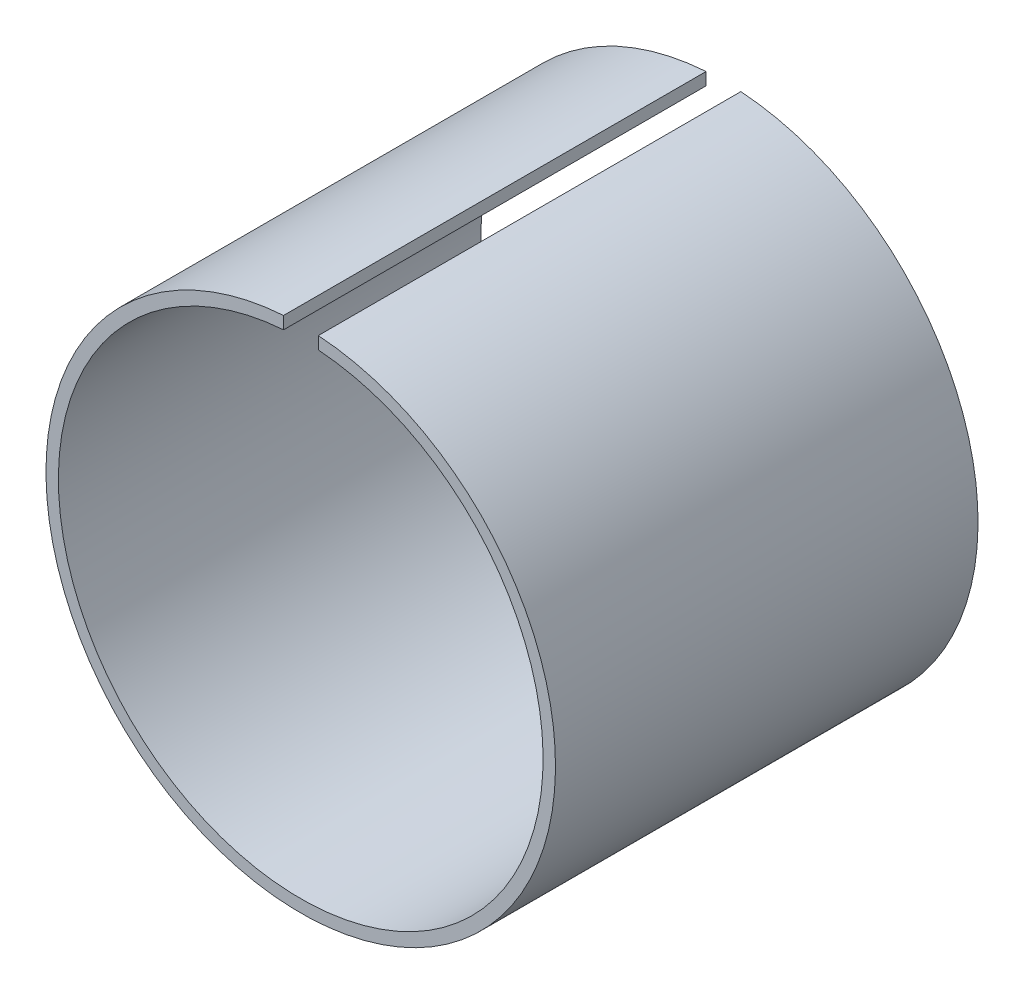
ISO-10303-21;
HEADER;
FILE_DESCRIPTION(('STEP AP214'),'2;1');
FILE_NAME('part.step','',(''),(''),'','','');
FILE_SCHEMA(('AUTOMOTIVE_DESIGN { 1 0 10303 214 1 1 1 1 }'));
ENDSEC;
DATA;
#1=APPLICATION_CONTEXT('core data for automotive mechanical design processes');
#2=APPLICATION_PROTOCOL_DEFINITION('international standard','automotive_design',2000,#1);
#3=PRODUCT_CONTEXT('',#1,'mechanical');
#4=PRODUCT('Part','Part','',(#3));
#5=PRODUCT_RELATED_PRODUCT_CATEGORY('part','',(#4));
#6=PRODUCT_DEFINITION_FORMATION('','',#4);
#7=PRODUCT_DEFINITION_CONTEXT('part definition',#1,'design');
#8=PRODUCT_DEFINITION('design','',#6,#7);
#9=PRODUCT_DEFINITION_SHAPE('','',#8);
#10=(LENGTH_UNIT() NAMED_UNIT(*) SI_UNIT(.MILLI.,.METRE.));
#11=(NAMED_UNIT(*) PLANE_ANGLE_UNIT() SI_UNIT($,.RADIAN.));
#12=(NAMED_UNIT(*) SI_UNIT($,.STERADIAN.) SOLID_ANGLE_UNIT());
#13=UNCERTAINTY_MEASURE_WITH_UNIT(LENGTH_MEASURE(1.E-05),#10,'distance_accuracy_value','');
#14=(GEOMETRIC_REPRESENTATION_CONTEXT(3) GLOBAL_UNCERTAINTY_ASSIGNED_CONTEXT((#13)) GLOBAL_UNIT_ASSIGNED_CONTEXT((#10,
#11,#12)) REPRESENTATION_CONTEXT('',''));
#15=CARTESIAN_POINT('',(0.,0.,0.));
#16=DIRECTION('',(0.,0.,1.));
#17=DIRECTION('',(1.,0.,0.));
#18=AXIS2_PLACEMENT_3D('',#15,#16,#17);
#19=CARTESIAN_POINT('',(0.,0.,34.));
#20=DIRECTION('',(0.,0.,1.));
#21=DIRECTION('',(1.,0.,0.));
#22=AXIS2_PLACEMENT_3D('',#19,#20,#21);
#23=PLANE('',#22);
#24=DIRECTION('',(0.,-1.,0.));
#25=VECTOR('',#24,1.);
#26=CARTESIAN_POINT('',(-1.38356082827795,20.9143769061307,34.));
#27=LINE('',#26,#25);
#28=CARTESIAN_POINT('',(-1.38356082827795,20.4532579173699,34.));
#29=VERTEX_POINT('',#28);
#30=CARTESIAN_POINT('',(-1.38356082827795,19.4508549795235,34.));
#31=VERTEX_POINT('',#30);
#32=EDGE_CURVE('E56',#29,#31,#27,.T.);
#33=ORIENTED_EDGE('',*,*,#32,.F.);
#34=CARTESIAN_POINT('',(0.,0.,34.));
#35=DIRECTION('',(0.,0.,1.));
#36=DIRECTION('',(1.,0.,0.));
#37=AXIS2_PLACEMENT_3D('',#34,#35,#36);
#38=CIRCLE('',#37,20.5);
#39=CARTESIAN_POINT('',(1.4144440824716,20.4511453942697,34.));
#40=VERTEX_POINT('',#39);
#41=EDGE_CURVE('E87',#29,#40,#38,.T.);
#42=ORIENTED_EDGE('',*,*,#41,.T.);
#43=DIRECTION('',(0.,1.,0.));
#44=VECTOR('',#43,1.);
#45=CARTESIAN_POINT('',(1.4144440824716,20.9143769061307,34.));
#46=LINE('',#45,#44);
#47=CARTESIAN_POINT('',(1.4144440824716,19.4486335750757,34.));
#48=VERTEX_POINT('',#47);
#49=EDGE_CURVE('E90',#48,#40,#46,.T.);
#50=ORIENTED_EDGE('',*,*,#49,.F.);
#51=CARTESIAN_POINT('',(0.,0.,34.));
#52=DIRECTION('',(0.,0.,1.));
#53=DIRECTION('',(1.,0.,0.));
#54=AXIS2_PLACEMENT_3D('',#51,#52,#53);
#55=CIRCLE('',#54,19.5);
#56=EDGE_CURVE('E89',#31,#48,#55,.T.);
#57=ORIENTED_EDGE('',*,*,#56,.F.);
#58=EDGE_LOOP('',(#33,#42,#50,#57));
#59=FACE_BOUND('',#58,.T.);
#60=ADVANCED_FACE('F34',(#59),#23,.T.);
#61=CARTESIAN_POINT('',(0.,0.,0.));
#62=DIRECTION('',(0.,0.,1.));
#63=DIRECTION('',(1.,0.,0.));
#64=AXIS2_PLACEMENT_3D('',#61,#62,#63);
#65=PLANE('',#64);
#66=CARTESIAN_POINT('',(0.,0.,0.));
#67=DIRECTION('',(0.,0.,1.));
#68=DIRECTION('',(1.,0.,0.));
#69=AXIS2_PLACEMENT_3D('',#66,#67,#68);
#70=CIRCLE('',#69,20.5);
#71=CARTESIAN_POINT('',(-1.38356082827795,20.4532579173699,0.));
#72=VERTEX_POINT('',#71);
#73=CARTESIAN_POINT('',(1.4144440824716,20.4511453942697,0.));
#74=VERTEX_POINT('',#73);
#75=EDGE_CURVE('E93',#72,#74,#70,.T.);
#76=ORIENTED_EDGE('',*,*,#75,.F.);
#77=DIRECTION('',(0.,-1.,0.));
#78=VECTOR('',#77,1.);
#79=CARTESIAN_POINT('',(-1.38356082827795,20.9143769061307,0.));
#80=LINE('',#79,#78);
#81=CARTESIAN_POINT('',(-1.38356082827795,19.4508549795235,0.));
#82=VERTEX_POINT('',#81);
#83=EDGE_CURVE('E75',#72,#82,#80,.T.);
#84=ORIENTED_EDGE('',*,*,#83,.T.);
#85=CARTESIAN_POINT('',(0.,0.,0.));
#86=DIRECTION('',(0.,0.,1.));
#87=DIRECTION('',(1.,0.,0.));
#88=AXIS2_PLACEMENT_3D('',#85,#86,#87);
#89=CIRCLE('',#88,19.5);
#90=CARTESIAN_POINT('',(1.4144440824716,19.4486335750757,0.));
#91=VERTEX_POINT('',#90);
#92=EDGE_CURVE('E80',#82,#91,#89,.T.);
#93=ORIENTED_EDGE('',*,*,#92,.T.);
#94=DIRECTION('',(0.,1.,0.));
#95=VECTOR('',#94,1.);
#96=CARTESIAN_POINT('',(1.4144440824716,20.9143769061307,0.));
#97=LINE('',#96,#95);
#98=EDGE_CURVE('E49',#91,#74,#97,.T.);
#99=ORIENTED_EDGE('',*,*,#98,.T.);
#100=EDGE_LOOP('',(#76,#84,#93,#99));
#101=FACE_BOUND('',#100,.T.);
#102=ADVANCED_FACE('F105',(#101),#65,.F.);
#103=CARTESIAN_POINT('',(0.,0.,34.));
#104=DIRECTION('',(0.,0.,-1.));
#105=DIRECTION('',(-1.,0.,0.));
#106=AXIS2_PLACEMENT_3D('',#103,#104,#105);
#107=CYLINDRICAL_SURFACE('',#106,20.5);
#108=ORIENTED_EDGE('',*,*,#41,.F.);
#109=DIRECTION('',(0.,0.,-1.));
#110=VECTOR('',#109,1.);
#111=CARTESIAN_POINT('',(-1.38356082827795,20.4532579173699,34.));
#112=LINE('',#111,#110);
#113=EDGE_CURVE('E72',#29,#72,#112,.T.);
#114=ORIENTED_EDGE('',*,*,#113,.T.);
#115=ORIENTED_EDGE('',*,*,#75,.T.);
#116=DIRECTION('',(0.,0.,-1.));
#117=VECTOR('',#116,1.);
#118=CARTESIAN_POINT('',(1.4144440824716,20.4511453942698,34.));
#119=LINE('',#118,#117);
#120=EDGE_CURVE('E81',#74,#40,#119,.F.);
#121=ORIENTED_EDGE('',*,*,#120,.T.);
#122=EDGE_LOOP('',(#108,#114,#115,#121));
#123=FACE_BOUND('',#122,.T.);
#124=ADVANCED_FACE('F36',(#123),#107,.T.);
#125=CARTESIAN_POINT('',(0.,0.,34.));
#126=DIRECTION('',(0.,0.,-1.));
#127=DIRECTION('',(-1.,0.,0.));
#128=AXIS2_PLACEMENT_3D('',#125,#126,#127);
#129=CYLINDRICAL_SURFACE('',#128,19.5);
#130=DIRECTION('',(0.,0.,-1.));
#131=VECTOR('',#130,1.);
#132=CARTESIAN_POINT('',(-1.38356082827795,19.4508549795235,34.));
#133=LINE('',#132,#131);
#134=EDGE_CURVE('E11',#31,#82,#133,.T.);
#135=ORIENTED_EDGE('',*,*,#134,.F.);
#136=ORIENTED_EDGE('',*,*,#56,.T.);
#137=DIRECTION('',(0.,0.,-1.));
#138=VECTOR('',#137,1.);
#139=CARTESIAN_POINT('',(1.4144440824716,19.4486335750757,34.));
#140=LINE('',#139,#138);
#141=EDGE_CURVE('E42',#91,#48,#140,.F.);
#142=ORIENTED_EDGE('',*,*,#141,.F.);
#143=ORIENTED_EDGE('',*,*,#92,.F.);
#144=EDGE_LOOP('',(#135,#136,#142,#143));
#145=FACE_BOUND('',#144,.T.);
#146=ADVANCED_FACE('F107',(#145),#129,.F.);
#147=CARTESIAN_POINT('',(1.4144440824716,20.9143769061307,0.));
#148=DIRECTION('',(1.,0.,0.));
#149=DIRECTION('',(0.,1.,0.));
#150=AXIS2_PLACEMENT_3D('',#147,#148,#149);
#151=PLANE('',#150);
#152=ORIENTED_EDGE('',*,*,#98,.F.);
#153=ORIENTED_EDGE('',*,*,#141,.T.);
#154=ORIENTED_EDGE('',*,*,#49,.T.);
#155=ORIENTED_EDGE('',*,*,#120,.F.);
#156=EDGE_LOOP('',(#152,#153,#154,#155));
#157=FACE_BOUND('',#156,.T.);
#158=ADVANCED_FACE('F108',(#157),#151,.F.);
#159=CARTESIAN_POINT('',(-1.38356082827795,20.9143769061307,0.));
#160=DIRECTION('',(-1.,0.,0.));
#161=DIRECTION('',(0.,0.,1.));
#162=AXIS2_PLACEMENT_3D('',#159,#160,#161);
#163=PLANE('',#162);
#164=ORIENTED_EDGE('',*,*,#32,.T.);
#165=ORIENTED_EDGE('',*,*,#134,.T.);
#166=ORIENTED_EDGE('',*,*,#83,.F.);
#167=ORIENTED_EDGE('',*,*,#113,.F.);
#168=EDGE_LOOP('',(#164,#165,#166,#167));
#169=FACE_BOUND('',#168,.T.);
#170=ADVANCED_FACE('F73',(#169),#163,.F.);
#171=CLOSED_SHELL('',(#60,#102,#124,#146,#158,#170));
#172=MANIFOLD_SOLID_BREP('B2',#171);
#173=ADVANCED_BREP_SHAPE_REPRESENTATION('',(#18,#172),#14);
#174=SHAPE_DEFINITION_REPRESENTATION(#9,#173);
ENDSEC;
END-ISO-10303-21;
